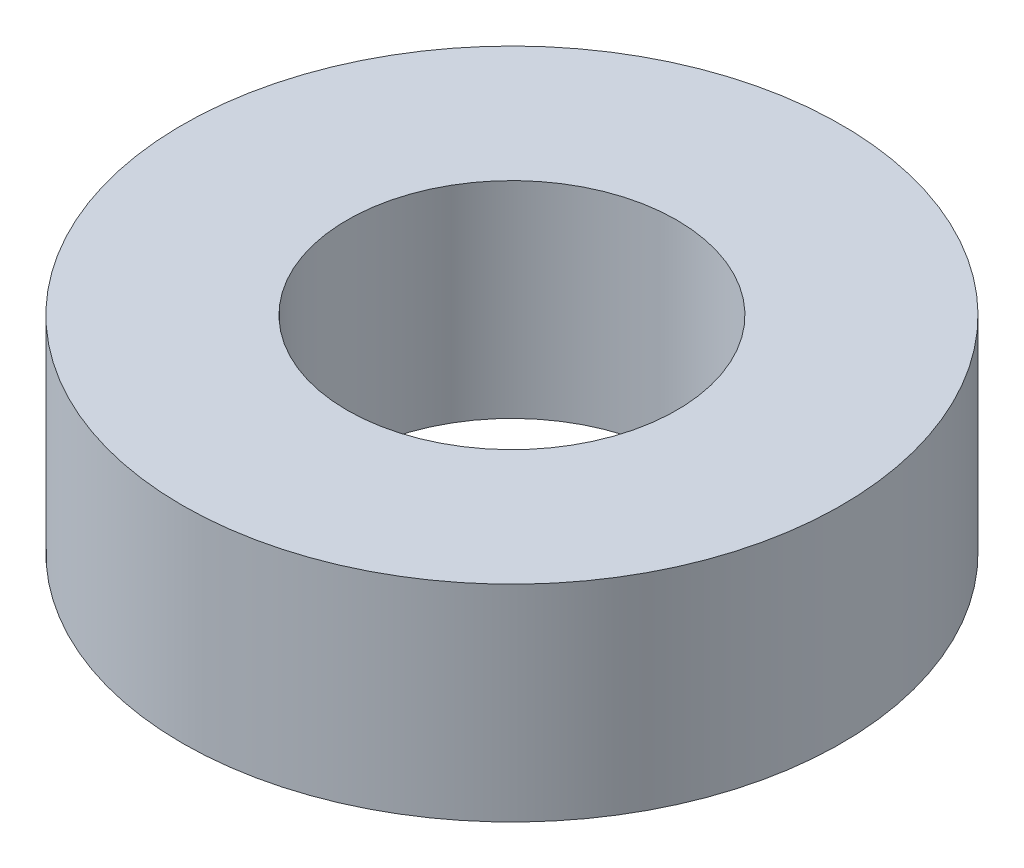
ISO-10303-21;
HEADER;
FILE_DESCRIPTION(('STEP AP214'),'2;1');
FILE_NAME('part.step','',(''),(''),'','','');
FILE_SCHEMA(('AUTOMOTIVE_DESIGN { 1 0 10303 214 1 1 1 1 }'));
ENDSEC;
DATA;
#1=APPLICATION_CONTEXT('core data for automotive mechanical design processes');
#2=APPLICATION_PROTOCOL_DEFINITION('international standard','automotive_design',2000,#1);
#3=PRODUCT_CONTEXT('',#1,'mechanical');
#4=PRODUCT('Part','Part','',(#3));
#5=PRODUCT_RELATED_PRODUCT_CATEGORY('part','',(#4));
#6=PRODUCT_DEFINITION_FORMATION('','',#4);
#7=PRODUCT_DEFINITION_CONTEXT('part definition',#1,'design');
#8=PRODUCT_DEFINITION('design','',#6,#7);
#9=PRODUCT_DEFINITION_SHAPE('','',#8);
#10=(LENGTH_UNIT() NAMED_UNIT(*) SI_UNIT(.MILLI.,.METRE.));
#11=(NAMED_UNIT(*) PLANE_ANGLE_UNIT() SI_UNIT($,.RADIAN.));
#12=(NAMED_UNIT(*) SI_UNIT($,.STERADIAN.) SOLID_ANGLE_UNIT());
#13=UNCERTAINTY_MEASURE_WITH_UNIT(LENGTH_MEASURE(1.E-05),#10,'distance_accuracy_value','');
#14=(GEOMETRIC_REPRESENTATION_CONTEXT(3) GLOBAL_UNCERTAINTY_ASSIGNED_CONTEXT((#13)) GLOBAL_UNIT_ASSIGNED_CONTEXT((#10,
#11,#12)) REPRESENTATION_CONTEXT('',''));
#15=CARTESIAN_POINT('',(0.,0.,0.));
#16=DIRECTION('',(0.,0.,1.));
#17=DIRECTION('',(1.,0.,0.));
#18=AXIS2_PLACEMENT_3D('',#15,#16,#17);
#19=CARTESIAN_POINT('',(0.,5.,0.));
#20=DIRECTION('',(0.,-1.,0.));
#21=DIRECTION('',(0.,0.,-1.));
#22=AXIS2_PLACEMENT_3D('',#19,#20,#21);
#23=CYLINDRICAL_SURFACE('',#22,8.);
#24=CARTESIAN_POINT('',(0.,5.,0.));
#25=DIRECTION('',(0.,1.,0.));
#26=DIRECTION('',(0.,0.,1.));
#27=AXIS2_PLACEMENT_3D('',#24,#25,#26);
#28=CIRCLE('',#27,8.);
#29=CARTESIAN_POINT('',(0.,5.,8.));
#30=VERTEX_POINT('',#29);
#31=EDGE_CURVE('E10',#30,#30,#28,.T.);
#32=ORIENTED_EDGE('',*,*,#31,.F.);
#33=EDGE_LOOP('',(#32));
#34=FACE_BOUND('',#33,.T.);
#35=CARTESIAN_POINT('',(0.,0.,0.));
#36=DIRECTION('',(0.,1.,0.));
#37=DIRECTION('',(0.,0.,1.));
#38=AXIS2_PLACEMENT_3D('',#35,#36,#37);
#39=CIRCLE('',#38,8.);
#40=CARTESIAN_POINT('',(0.,0.,8.));
#41=VERTEX_POINT('',#40);
#42=EDGE_CURVE('E39',#41,#41,#39,.T.);
#43=ORIENTED_EDGE('',*,*,#42,.T.);
#44=EDGE_LOOP('',(#43));
#45=FACE_BOUND('',#44,.T.);
#46=ADVANCED_FACE('F36',(#34,#45),#23,.T.);
#47=CARTESIAN_POINT('',(0.,5.,0.));
#48=DIRECTION('',(0.,1.,0.));
#49=DIRECTION('',(0.,0.,1.));
#50=AXIS2_PLACEMENT_3D('',#47,#48,#49);
#51=PLANE('',#50);
#52=CARTESIAN_POINT('',(0.,5.,0.));
#53=DIRECTION('',(0.,1.,0.));
#54=DIRECTION('',(0.,0.,1.));
#55=AXIS2_PLACEMENT_3D('',#52,#53,#54);
#56=CIRCLE('',#55,4.);
#57=CARTESIAN_POINT('',(0.,5.,4.));
#58=VERTEX_POINT('',#57);
#59=EDGE_CURVE('E53',#58,#58,#56,.T.);
#60=ORIENTED_EDGE('',*,*,#59,.F.);
#61=EDGE_LOOP('',(#60));
#62=FACE_BOUND('',#61,.T.);
#63=ORIENTED_EDGE('',*,*,#31,.T.);
#64=EDGE_LOOP('',(#63));
#65=FACE_BOUND('',#64,.T.);
#66=ADVANCED_FACE('F60',(#62,#65),#51,.T.);
#67=CARTESIAN_POINT('',(0.,0.,0.));
#68=DIRECTION('',(0.,1.,0.));
#69=DIRECTION('',(0.,0.,1.));
#70=AXIS2_PLACEMENT_3D('',#67,#68,#69);
#71=PLANE('',#70);
#72=CARTESIAN_POINT('',(0.,0.,0.));
#73=DIRECTION('',(0.,1.,0.));
#74=DIRECTION('',(0.,0.,1.));
#75=AXIS2_PLACEMENT_3D('',#72,#73,#74);
#76=CIRCLE('',#75,4.);
#77=CARTESIAN_POINT('',(0.,0.,4.));
#78=VERTEX_POINT('',#77);
#79=EDGE_CURVE('E48',#78,#78,#76,.F.);
#80=ORIENTED_EDGE('',*,*,#79,.F.);
#81=EDGE_LOOP('',(#80));
#82=FACE_BOUND('',#81,.T.);
#83=ORIENTED_EDGE('',*,*,#42,.F.);
#84=EDGE_LOOP('',(#83));
#85=FACE_BOUND('',#84,.T.);
#86=ADVANCED_FACE('F62',(#82,#85),#71,.F.);
#87=CARTESIAN_POINT('',(0.,-11.3137084989848,0.));
#88=DIRECTION('',(0.,1.,0.));
#89=DIRECTION('',(0.,0.,1.));
#90=AXIS2_PLACEMENT_3D('',#87,#88,#89);
#91=CYLINDRICAL_SURFACE('',#90,4.);
#92=ORIENTED_EDGE('',*,*,#79,.T.);
#93=EDGE_LOOP('',(#92));
#94=FACE_BOUND('',#93,.T.);
#95=ORIENTED_EDGE('',*,*,#59,.T.);
#96=EDGE_LOOP('',(#95));
#97=FACE_BOUND('',#96,.T.);
#98=ADVANCED_FACE('F58',(#94,#97),#91,.F.);
#99=CLOSED_SHELL('',(#46,#66,#86,#98));
#100=MANIFOLD_SOLID_BREP('B2',#99);
#101=ADVANCED_BREP_SHAPE_REPRESENTATION('',(#18,#100),#14);
#102=SHAPE_DEFINITION_REPRESENTATION(#9,#101);
ENDSEC;
END-ISO-10303-21;
